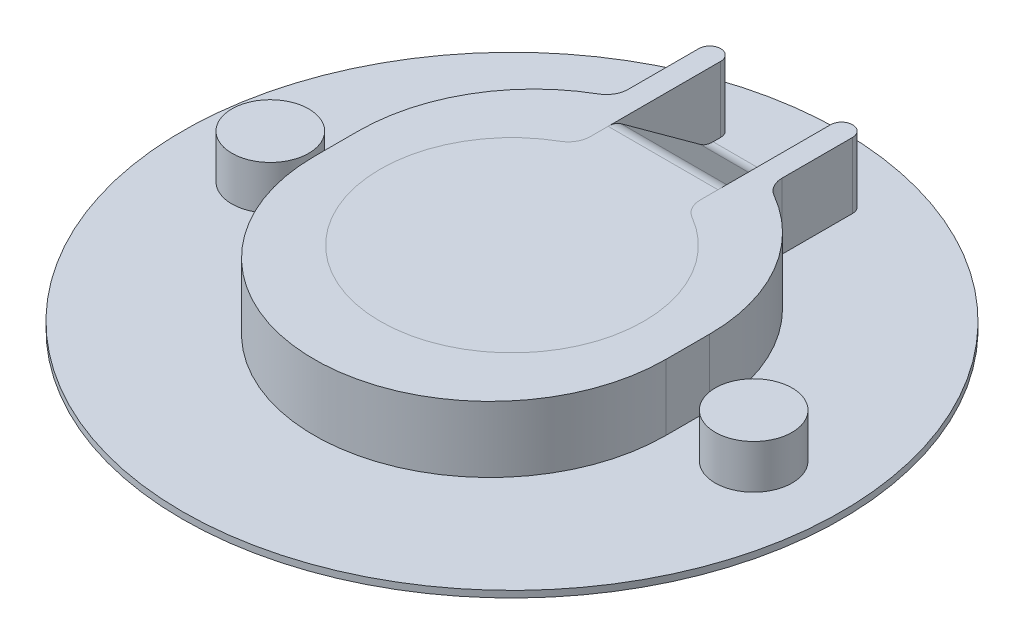
ISO-10303-21;
HEADER;
FILE_DESCRIPTION(('STEP AP214'),'2;1');
FILE_NAME('part.step','',(''),(''),'','','');
FILE_SCHEMA(('AUTOMOTIVE_DESIGN { 1 0 10303 214 1 1 1 1 }'));
ENDSEC;
DATA;
#1=APPLICATION_CONTEXT('core data for automotive mechanical design processes');
#2=APPLICATION_PROTOCOL_DEFINITION('international standard','automotive_design',2000,#1);
#3=PRODUCT_CONTEXT('',#1,'mechanical');
#4=PRODUCT('Part','Part','',(#3));
#5=PRODUCT_RELATED_PRODUCT_CATEGORY('part','',(#4));
#6=PRODUCT_DEFINITION_FORMATION('','',#4);
#7=PRODUCT_DEFINITION_CONTEXT('part definition',#1,'design');
#8=PRODUCT_DEFINITION('design','',#6,#7);
#9=PRODUCT_DEFINITION_SHAPE('','',#8);
#10=(LENGTH_UNIT() NAMED_UNIT(*) SI_UNIT(.MILLI.,.METRE.));
#11=(NAMED_UNIT(*) PLANE_ANGLE_UNIT() SI_UNIT($,.RADIAN.));
#12=(NAMED_UNIT(*) SI_UNIT($,.STERADIAN.) SOLID_ANGLE_UNIT());
#13=UNCERTAINTY_MEASURE_WITH_UNIT(LENGTH_MEASURE(1.E-05),#10,'distance_accuracy_value','');
#14=(GEOMETRIC_REPRESENTATION_CONTEXT(3) GLOBAL_UNCERTAINTY_ASSIGNED_CONTEXT((#13)) GLOBAL_UNIT_ASSIGNED_CONTEXT((#10,
#11,#12)) REPRESENTATION_CONTEXT('',''));
#15=CARTESIAN_POINT('',(0.,0.,0.));
#16=DIRECTION('',(0.,0.,1.));
#17=DIRECTION('',(1.,0.,0.));
#18=AXIS2_PLACEMENT_3D('',#15,#16,#17);
#19=CARTESIAN_POINT('',(0.,3.3,0.));
#20=DIRECTION('',(0.,1.,0.));
#21=DIRECTION('',(0.,0.,1.));
#22=AXIS2_PLACEMENT_3D('',#19,#20,#21);
#23=PLANE('',#22);
#24=CARTESIAN_POINT('',(3.5,3.3,-6.06217782649107));
#25=DIRECTION('',(0.,1.,0.));
#26=DIRECTION('',(0.,0.,1.));
#27=AXIS2_PLACEMENT_3D('',#24,#25,#26);
#28=CIRCLE('',#27,1.);
#29=CARTESIAN_POINT('',(3.,3.3,-5.19615242270663));
#30=VERTEX_POINT('',#29);
#31=CARTESIAN_POINT('',(2.5,3.3,-6.06217782649107));
#32=VERTEX_POINT('',#31);
#33=EDGE_CURVE('E173',#30,#32,#28,.F.);
#34=ORIENTED_EDGE('',*,*,#33,.T.);
#35=DIRECTION('',(0.,0.,-1.));
#36=VECTOR('',#35,1.);
#37=CARTESIAN_POINT('',(2.5,3.3,0.));
#38=LINE('',#37,#36);
#39=CARTESIAN_POINT('',(2.5,3.3,-6.87508030376707));
#40=VERTEX_POINT('',#39);
#41=EDGE_CURVE('E13',#32,#40,#38,.T.);
#42=ORIENTED_EDGE('',*,*,#41,.T.);
#43=DIRECTION('',(1.,0.,0.));
#44=VECTOR('',#43,1.);
#45=CARTESIAN_POINT('',(0.,3.3,-6.87508030376707));
#46=LINE('',#45,#44);
#47=CARTESIAN_POINT('',(-2.5,3.3,-6.87508030376707));
#48=VERTEX_POINT('',#47);
#49=EDGE_CURVE('E411',#40,#48,#46,.F.);
#50=ORIENTED_EDGE('',*,*,#49,.T.);
#51=DIRECTION('',(0.,0.,1.));
#52=VECTOR('',#51,1.);
#53=CARTESIAN_POINT('',(-2.5,3.3,0.));
#54=LINE('',#53,#52);
#55=CARTESIAN_POINT('',(-2.5,3.3,-6.06217782649107));
#56=VERTEX_POINT('',#55);
#57=EDGE_CURVE('E419',#48,#56,#54,.T.);
#58=ORIENTED_EDGE('',*,*,#57,.T.);
#59=CARTESIAN_POINT('',(-3.5,3.3,-6.06217782649107));
#60=DIRECTION('',(0.,1.,0.));
#61=DIRECTION('',(0.,0.,1.));
#62=AXIS2_PLACEMENT_3D('',#59,#60,#61);
#63=CIRCLE('',#62,1.);
#64=CARTESIAN_POINT('',(-3.,3.3,-5.19615242270664));
#65=VERTEX_POINT('',#64);
#66=EDGE_CURVE('E423',#56,#65,#63,.F.);
#67=ORIENTED_EDGE('',*,*,#66,.T.);
#68=CARTESIAN_POINT('',(0.,3.3,0.));
#69=DIRECTION('',(0.,1.,0.));
#70=DIRECTION('',(0.,0.,1.));
#71=AXIS2_PLACEMENT_3D('',#68,#69,#70);
#72=CIRCLE('',#71,6.);
#73=EDGE_CURVE('E427',#65,#30,#72,.T.);
#74=ORIENTED_EDGE('',*,*,#73,.T.);
#75=EDGE_LOOP('',(#34,#42,#50,#58,#67,#74));
#76=FACE_BOUND('',#75,.T.);
#77=ADVANCED_FACE('F164',(#76),#23,.T.);
#78=CARTESIAN_POINT('',(3.5,0.29,16.4624993421338));
#79=DIRECTION('',(-1.,0.,0.));
#80=DIRECTION('',(0.,0.,1.));
#81=AXIS2_PLACEMENT_3D('',#78,#79,#80);
#82=PLANE('',#81);
#83=DIRECTION('',(0.,0.,1.));
#84=VECTOR('',#83,1.);
#85=CARTESIAN_POINT('',(3.5,3.3,-11.4));
#86=LINE('',#85,#84);
#87=CARTESIAN_POINT('',(3.5,3.3,-12.));
#88=VERTEX_POINT('',#87);
#89=CARTESIAN_POINT('',(3.5,3.3,-8.79422863405995));
#90=VERTEX_POINT('',#89);
#91=EDGE_CURVE('E341',#88,#90,#86,.T.);
#92=ORIENTED_EDGE('',*,*,#91,.T.);
#93=DIRECTION('',(0.,1.,0.));
#94=VECTOR('',#93,1.);
#95=CARTESIAN_POINT('',(3.5,0.3,-8.79422863405995));
#96=LINE('',#95,#94);
#97=CARTESIAN_POINT('',(3.5,0.3,-8.79422863405995));
#98=VERTEX_POINT('',#97);
#99=EDGE_CURVE('E391',#90,#98,#96,.F.);
#100=ORIENTED_EDGE('',*,*,#99,.T.);
#101=DIRECTION('',(0.,0.,1.));
#102=VECTOR('',#101,1.);
#103=CARTESIAN_POINT('',(3.5,0.3,-11.4));
#104=LINE('',#103,#102);
#105=CARTESIAN_POINT('',(3.5,0.3,-12.));
#106=VERTEX_POINT('',#105);
#107=EDGE_CURVE('E366',#106,#98,#104,.T.);
#108=ORIENTED_EDGE('',*,*,#107,.F.);
#109=DIRECTION('',(0.,-1.,0.));
#110=VECTOR('',#109,1.);
#111=CARTESIAN_POINT('',(3.5,3.3,-12.));
#112=LINE('',#111,#110);
#113=EDGE_CURVE('E364',#88,#106,#112,.T.);
#114=ORIENTED_EDGE('',*,*,#113,.F.);
#115=EDGE_LOOP('',(#92,#100,#108,#114));
#116=FACE_BOUND('',#115,.T.);
#117=ADVANCED_FACE('F499',(#116),#82,.F.);
#118=CARTESIAN_POINT('',(2.5,0.29,16.4624993421338));
#119=DIRECTION('',(1.,0.,0.));
#120=DIRECTION('',(0.,0.,-1.));
#121=AXIS2_PLACEMENT_3D('',#118,#119,#120);
#122=PLANE('',#121);
#123=DIRECTION('',(0.,0.,-1.));
#124=VECTOR('',#123,1.);
#125=CARTESIAN_POINT('',(2.5,0.3,0.));
#126=LINE('',#125,#124);
#127=CARTESIAN_POINT('',(2.5,0.3,-11.6540654576464));
#128=VERTEX_POINT('',#127);
#129=CARTESIAN_POINT('',(2.5,0.3,-12.));
#130=VERTEX_POINT('',#129);
#131=EDGE_CURVE('E370',#128,#130,#126,.T.);
#132=ORIENTED_EDGE('',*,*,#131,.F.);
#133=CARTESIAN_POINT('',(2.5,1.3,-11.6540654576464));
#134=DIRECTION('',(1.,0.,0.));
#135=DIRECTION('',(0.,0.,-1.));
#136=AXIS2_PLACEMENT_3D('',#133,#134,#135);
#137=CIRCLE('',#136,1.);
#138=CARTESIAN_POINT('',(2.5,0.490983005625051,-11.0662802053539));
#139=VERTEX_POINT('',#138);
#140=EDGE_CURVE('E403',#128,#139,#137,.F.);
#141=ORIENTED_EDGE('',*,*,#140,.T.);
#142=DIRECTION('',(0.,-0.587785252292478,-0.809016994374944));
#143=VECTOR('',#142,1.);
#144=CARTESIAN_POINT('',(2.5,13.5122576721174,6.85596682709528));
#145=LINE('',#144,#143);
#146=CARTESIAN_POINT('',(2.5,3.10901699437494,-7.46286555605955));
#147=VERTEX_POINT('',#146);
#148=EDGE_CURVE('E452',#139,#147,#145,.F.);
#149=ORIENTED_EDGE('',*,*,#148,.T.);
#150=CARTESIAN_POINT('',(2.5,2.3,-6.87508030376707));
#151=DIRECTION('',(1.,0.,0.));
#152=DIRECTION('',(0.,0.,-1.));
#153=AXIS2_PLACEMENT_3D('',#150,#151,#152);
#154=CIRCLE('',#153,1.);
#155=EDGE_CURVE('E416',#147,#40,#154,.T.);
#156=ORIENTED_EDGE('',*,*,#155,.T.);
#157=DIRECTION('',(0.,0.,-1.));
#158=VECTOR('',#157,1.);
#159=CARTESIAN_POINT('',(2.5,3.3,0.));
#160=LINE('',#159,#158);
#161=CARTESIAN_POINT('',(2.5,3.3,-12.));
#162=VERTEX_POINT('',#161);
#163=EDGE_CURVE('E371',#40,#162,#160,.T.);
#164=ORIENTED_EDGE('',*,*,#163,.T.);
#165=DIRECTION('',(0.,-1.,0.));
#166=VECTOR('',#165,1.);
#167=CARTESIAN_POINT('',(2.5,3.3,-12.));
#168=LINE('',#167,#166);
#169=EDGE_CURVE('E360',#162,#130,#168,.T.);
#170=ORIENTED_EDGE('',*,*,#169,.T.);
#171=EDGE_LOOP('',(#132,#141,#149,#156,#164,#170));
#172=FACE_BOUND('',#171,.T.);
#173=ADVANCED_FACE('F504',(#172),#122,.F.);
#174=CARTESIAN_POINT('',(3.,3.3,-12.));
#175=DIRECTION('',(0.,-1.,0.));
#176=DIRECTION('',(0.,0.,-1.));
#177=AXIS2_PLACEMENT_3D('',#174,#175,#176);
#178=CYLINDRICAL_SURFACE('',#177,0.499999999999998);
#179=CARTESIAN_POINT('',(3.,0.3,-12.));
#180=DIRECTION('',(0.,-1.,0.));
#181=DIRECTION('',(0.,0.,-1.));
#182=AXIS2_PLACEMENT_3D('',#179,#180,#181);
#183=CIRCLE('',#182,0.499999999999998);
#184=EDGE_CURVE('E367',#130,#106,#183,.T.);
#185=ORIENTED_EDGE('',*,*,#184,.F.);
#186=ORIENTED_EDGE('',*,*,#169,.F.);
#187=CARTESIAN_POINT('',(3.,3.3,-12.));
#188=DIRECTION('',(0.,-1.,0.));
#189=DIRECTION('',(0.,0.,-1.));
#190=AXIS2_PLACEMENT_3D('',#187,#188,#189);
#191=CIRCLE('',#190,0.499999999999998);
#192=EDGE_CURVE('E363',#162,#88,#191,.T.);
#193=ORIENTED_EDGE('',*,*,#192,.T.);
#194=ORIENTED_EDGE('',*,*,#113,.T.);
#195=EDGE_LOOP('',(#185,#186,#193,#194));
#196=FACE_BOUND('',#195,.T.);
#197=ADVANCED_FACE('F518',(#196),#178,.T.);
#198=CARTESIAN_POINT('',(0.,3.3,1.));
#199=DIRECTION('',(0.,-1.,0.));
#200=DIRECTION('',(0.,0.,-1.));
#201=AXIS2_PLACEMENT_3D('',#198,#199,#200);
#202=CYLINDRICAL_SURFACE('',#201,8.);
#203=CARTESIAN_POINT('',(0.,3.3,1.));
#204=DIRECTION('',(0.,1.,0.));
#205=DIRECTION('',(0.,0.,1.));
#206=AXIS2_PLACEMENT_3D('',#203,#204,#205);
#207=CIRCLE('',#206,8.);
#208=CARTESIAN_POINT('',(-8.,3.3,0.999999999999999));
#209=VERTEX_POINT('',#208);
#210=CARTESIAN_POINT('',(8.,3.3,1.));
#211=VERTEX_POINT('',#210);
#212=EDGE_CURVE('E373',#209,#211,#207,.T.);
#213=ORIENTED_EDGE('',*,*,#212,.F.);
#214=DIRECTION('',(0.,-1.,0.));
#215=VECTOR('',#214,1.);
#216=CARTESIAN_POINT('',(-8.,3.3,0.999999999999999));
#217=LINE('',#216,#215);
#218=CARTESIAN_POINT('',(-8.,0.3,0.999999999999999));
#219=VERTEX_POINT('',#218);
#220=EDGE_CURVE('E304',#209,#219,#217,.T.);
#221=ORIENTED_EDGE('',*,*,#220,.T.);
#222=CARTESIAN_POINT('',(0.,0.3,1.));
#223=DIRECTION('',(0.,1.,0.));
#224=DIRECTION('',(0.,0.,1.));
#225=AXIS2_PLACEMENT_3D('',#222,#223,#224);
#226=CIRCLE('',#225,8.);
#227=CARTESIAN_POINT('',(8.,0.3,1.));
#228=VERTEX_POINT('',#227);
#229=EDGE_CURVE('E380',#219,#228,#226,.T.);
#230=ORIENTED_EDGE('',*,*,#229,.T.);
#231=DIRECTION('',(0.,-1.,0.));
#232=VECTOR('',#231,1.);
#233=CARTESIAN_POINT('',(8.,3.3,1.));
#234=LINE('',#233,#232);
#235=EDGE_CURVE('E296',#211,#228,#234,.T.);
#236=ORIENTED_EDGE('',*,*,#235,.F.);
#237=EDGE_LOOP('',(#213,#221,#230,#236));
#238=FACE_BOUND('',#237,.T.);
#239=ADVANCED_FACE('F511',(#238),#202,.T.);
#240=ORIENTED_EDGE('',*,*,#41,.F.);
#241=ORIENTED_EDGE('',*,*,#33,.F.);
#242=ORIENTED_EDGE('',*,*,#73,.F.);
#243=ORIENTED_EDGE('',*,*,#66,.F.);
#244=ORIENTED_EDGE('',*,*,#57,.F.);
#245=DIRECTION('',(0.,0.,-1.));
#246=VECTOR('',#245,1.);
#247=CARTESIAN_POINT('',(-2.5,3.3,0.));
#248=LINE('',#247,#246);
#249=CARTESIAN_POINT('',(-2.5,3.3,-12.));
#250=VERTEX_POINT('',#249);
#251=EDGE_CURVE('E346',#48,#250,#248,.T.);
#252=ORIENTED_EDGE('',*,*,#251,.T.);
#253=CARTESIAN_POINT('',(-3.,3.3,-12.));
#254=DIRECTION('',(0.,1.,0.));
#255=DIRECTION('',(0.,0.,1.));
#256=AXIS2_PLACEMENT_3D('',#253,#254,#255);
#257=CIRCLE('',#256,0.499999999999998);
#258=CARTESIAN_POINT('',(-3.5,3.3,-12.));
#259=VERTEX_POINT('',#258);
#260=EDGE_CURVE('E348',#250,#259,#257,.T.);
#261=ORIENTED_EDGE('',*,*,#260,.T.);
#262=DIRECTION('',(0.,0.,1.));
#263=VECTOR('',#262,1.);
#264=CARTESIAN_POINT('',(-3.5,3.3,-11.4));
#265=LINE('',#264,#263);
#266=CARTESIAN_POINT('',(-3.5,3.3,-8.79422863405995));
#267=VERTEX_POINT('',#266);
#268=EDGE_CURVE('E338',#259,#267,#265,.T.);
#269=ORIENTED_EDGE('',*,*,#268,.T.);
#270=CARTESIAN_POINT('',(-4.5,3.3,-8.79422863405995));
#271=DIRECTION('',(0.,1.,0.));
#272=DIRECTION('',(0.,0.,1.));
#273=AXIS2_PLACEMENT_3D('',#270,#271,#272);
#274=CIRCLE('',#273,1.);
#275=CARTESIAN_POINT('',(-4.,3.3,-7.92820323027551));
#276=VERTEX_POINT('',#275);
#277=EDGE_CURVE('E396',#267,#276,#274,.F.);
#278=ORIENTED_EDGE('',*,*,#277,.T.);
#279=CARTESIAN_POINT('',(0.,3.3,-1.));
#280=DIRECTION('',(0.,1.,0.));
#281=DIRECTION('',(0.,0.,1.));
#282=AXIS2_PLACEMENT_3D('',#279,#280,#281);
#283=CIRCLE('',#282,8.);
#284=CARTESIAN_POINT('',(-8.,3.3,-1.));
#285=VERTEX_POINT('',#284);
#286=EDGE_CURVE('E321',#276,#285,#283,.T.);
#287=ORIENTED_EDGE('',*,*,#286,.T.);
#288=DIRECTION('',(0.,0.,1.));
#289=VECTOR('',#288,1.);
#290=CARTESIAN_POINT('',(-8.,3.3,-1.));
#291=LINE('',#290,#289);
#292=EDGE_CURVE('E327',#285,#209,#291,.T.);
#293=ORIENTED_EDGE('',*,*,#292,.T.);
#294=ORIENTED_EDGE('',*,*,#212,.T.);
#295=DIRECTION('',(0.,0.,1.));
#296=VECTOR('',#295,1.);
#297=CARTESIAN_POINT('',(8.,3.3,-1.));
#298=LINE('',#297,#296);
#299=CARTESIAN_POINT('',(8.,3.3,-1.));
#300=VERTEX_POINT('',#299);
#301=EDGE_CURVE('E311',#300,#211,#298,.T.);
#302=ORIENTED_EDGE('',*,*,#301,.F.);
#303=CARTESIAN_POINT('',(0.,3.3,-1.));
#304=DIRECTION('',(0.,1.,0.));
#305=DIRECTION('',(0.,0.,1.));
#306=AXIS2_PLACEMENT_3D('',#303,#304,#305);
#307=CIRCLE('',#306,8.);
#308=CARTESIAN_POINT('',(4.,3.3,-7.92820323027551));
#309=VERTEX_POINT('',#308);
#310=EDGE_CURVE('E292',#300,#309,#307,.T.);
#311=ORIENTED_EDGE('',*,*,#310,.T.);
#312=CARTESIAN_POINT('',(4.5,3.3,-8.79422863405995));
#313=DIRECTION('',(0.,1.,0.));
#314=DIRECTION('',(0.,0.,1.));
#315=AXIS2_PLACEMENT_3D('',#312,#313,#314);
#316=CIRCLE('',#315,1.);
#317=EDGE_CURVE('E398',#309,#90,#316,.F.);
#318=ORIENTED_EDGE('',*,*,#317,.T.);
#319=ORIENTED_EDGE('',*,*,#91,.F.);
#320=ORIENTED_EDGE('',*,*,#192,.F.);
#321=ORIENTED_EDGE('',*,*,#163,.F.);
#322=EDGE_LOOP('',(#240,#241,#242,#243,#244,#252,#261,#269,#278,#287,#293,#294,#302,#311,#318,
#319,#320,#321));
#323=FACE_BOUND('',#322,.T.);
#324=ADVANCED_FACE('F433',(#323),#23,.T.);
#325=CARTESIAN_POINT('',(-3.5,3.3,-11.4));
#326=DIRECTION('',(1.,0.,0.));
#327=DIRECTION('',(0.,0.,-1.));
#328=AXIS2_PLACEMENT_3D('',#325,#326,#327);
#329=PLANE('',#328);
#330=DIRECTION('',(0.,0.,1.));
#331=VECTOR('',#330,1.);
#332=CARTESIAN_POINT('',(-3.5,0.3,-11.4));
#333=LINE('',#332,#331);
#334=CARTESIAN_POINT('',(-3.5,0.3,-12.));
#335=VERTEX_POINT('',#334);
#336=CARTESIAN_POINT('',(-3.5,0.3,-8.79422863405995));
#337=VERTEX_POINT('',#336);
#338=EDGE_CURVE('E342',#335,#337,#333,.T.);
#339=ORIENTED_EDGE('',*,*,#338,.T.);
#340=DIRECTION('',(0.,1.,0.));
#341=VECTOR('',#340,1.);
#342=CARTESIAN_POINT('',(-3.5,3.3,-8.79422863405995));
#343=LINE('',#342,#341);
#344=EDGE_CURVE('E389',#337,#267,#343,.T.);
#345=ORIENTED_EDGE('',*,*,#344,.T.);
#346=ORIENTED_EDGE('',*,*,#268,.F.);
#347=DIRECTION('',(0.,-1.,0.));
#348=VECTOR('',#347,1.);
#349=CARTESIAN_POINT('',(-3.5,3.3,-12.));
#350=LINE('',#349,#348);
#351=EDGE_CURVE('E352',#259,#335,#350,.T.);
#352=ORIENTED_EDGE('',*,*,#351,.T.);
#353=EDGE_LOOP('',(#339,#345,#346,#352));
#354=FACE_BOUND('',#353,.T.);
#355=ADVANCED_FACE('F510',(#354),#329,.F.);
#356=CARTESIAN_POINT('',(-3.,3.3,-12.));
#357=DIRECTION('',(0.,-1.,0.));
#358=DIRECTION('',(0.,0.,-1.));
#359=AXIS2_PLACEMENT_3D('',#356,#357,#358);
#360=CYLINDRICAL_SURFACE('',#359,0.499999999999998);
#361=CARTESIAN_POINT('',(-3.,0.3,-12.));
#362=DIRECTION('',(0.,1.,0.));
#363=DIRECTION('',(0.,0.,1.));
#364=AXIS2_PLACEMENT_3D('',#361,#362,#363);
#365=CIRCLE('',#364,0.499999999999998);
#366=CARTESIAN_POINT('',(-2.5,0.3,-12.));
#367=VERTEX_POINT('',#366);
#368=EDGE_CURVE('E349',#367,#335,#365,.T.);
#369=ORIENTED_EDGE('',*,*,#368,.T.);
#370=ORIENTED_EDGE('',*,*,#351,.F.);
#371=ORIENTED_EDGE('',*,*,#260,.F.);
#372=DIRECTION('',(0.,-1.,0.));
#373=VECTOR('',#372,1.);
#374=CARTESIAN_POINT('',(-2.5,3.3,-12.));
#375=LINE('',#374,#373);
#376=EDGE_CURVE('E345',#250,#367,#375,.T.);
#377=ORIENTED_EDGE('',*,*,#376,.T.);
#378=EDGE_LOOP('',(#369,#370,#371,#377));
#379=FACE_BOUND('',#378,.T.);
#380=ADVANCED_FACE('F483',(#379),#360,.T.);
#381=CARTESIAN_POINT('',(-2.5,3.3,0.));
#382=DIRECTION('',(-1.,0.,0.));
#383=DIRECTION('',(0.,0.,1.));
#384=AXIS2_PLACEMENT_3D('',#381,#382,#383);
#385=PLANE('',#384);
#386=DIRECTION('',(0.,0.587785252292478,0.809016994374944));
#387=VECTOR('',#386,1.);
#388=CARTESIAN_POINT('',(-2.5,0.24852138237743,-11.4));
#389=LINE('',#388,#387);
#390=CARTESIAN_POINT('',(-2.5,3.10901699437494,-7.46286555605955));
#391=VERTEX_POINT('',#390);
#392=CARTESIAN_POINT('',(-2.5,0.490983005625056,-11.0662802053539));
#393=VERTEX_POINT('',#392);
#394=EDGE_CURVE('E444',#391,#393,#389,.F.);
#395=ORIENTED_EDGE('',*,*,#394,.T.);
#396=CARTESIAN_POINT('',(-2.5,1.3,-11.6540654576464));
#397=DIRECTION('',(-1.,0.,0.));
#398=DIRECTION('',(0.,0.,1.));
#399=AXIS2_PLACEMENT_3D('',#396,#397,#398);
#400=CIRCLE('',#399,1.);
#401=CARTESIAN_POINT('',(-2.5,0.3,-11.6540654576464));
#402=VERTEX_POINT('',#401);
#403=EDGE_CURVE('E409',#393,#402,#400,.F.);
#404=ORIENTED_EDGE('',*,*,#403,.T.);
#405=DIRECTION('',(0.,0.,-1.));
#406=VECTOR('',#405,1.);
#407=CARTESIAN_POINT('',(-2.5,0.3,0.));
#408=LINE('',#407,#406);
#409=EDGE_CURVE('E335',#402,#367,#408,.T.);
#410=ORIENTED_EDGE('',*,*,#409,.T.);
#411=ORIENTED_EDGE('',*,*,#376,.F.);
#412=ORIENTED_EDGE('',*,*,#251,.F.);
#413=CARTESIAN_POINT('',(-2.5,2.3,-6.87508030376707));
#414=DIRECTION('',(-1.,0.,0.));
#415=DIRECTION('',(0.,0.,1.));
#416=AXIS2_PLACEMENT_3D('',#413,#414,#415);
#417=CIRCLE('',#416,1.);
#418=EDGE_CURVE('E414',#48,#391,#417,.T.);
#419=ORIENTED_EDGE('',*,*,#418,.T.);
#420=EDGE_LOOP('',(#395,#404,#410,#411,#412,#419));
#421=FACE_BOUND('',#420,.T.);
#422=ADVANCED_FACE('F443',(#421),#385,.F.);
#423=CARTESIAN_POINT('',(0.,0.3,0.));
#424=DIRECTION('',(0.,1.,0.));
#425=DIRECTION('',(0.,0.,1.));
#426=AXIS2_PLACEMENT_3D('',#423,#424,#425);
#427=PLANE('',#426);
#428=CARTESIAN_POINT('',(11.,0.3,0.));
#429=DIRECTION('',(0.,1.,0.));
#430=DIRECTION('',(0.,0.,1.));
#431=AXIS2_PLACEMENT_3D('',#428,#429,#430);
#432=CIRCLE('',#431,1.75);
#433=CARTESIAN_POINT('',(11.,0.3,1.75));
#434=VERTEX_POINT('',#433);
#435=EDGE_CURVE('E464',#434,#434,#432,.T.);
#436=ORIENTED_EDGE('',*,*,#435,.F.);
#437=EDGE_LOOP('',(#436));
#438=FACE_BOUND('',#437,.T.);
#439=CARTESIAN_POINT('',(-11.,0.3,0.));
#440=DIRECTION('',(0.,1.,0.));
#441=DIRECTION('',(0.,0.,1.));
#442=AXIS2_PLACEMENT_3D('',#439,#440,#441);
#443=CIRCLE('',#442,1.75);
#444=CARTESIAN_POINT('',(-11.,0.3,1.75));
#445=VERTEX_POINT('',#444);
#446=EDGE_CURVE('E458',#445,#445,#443,.T.);
#447=ORIENTED_EDGE('',*,*,#446,.F.);
#448=EDGE_LOOP('',(#447));
#449=FACE_BOUND('',#448,.T.);
#450=ORIENTED_EDGE('',*,*,#409,.F.);
#451=DIRECTION('',(-1.,0.,0.));
#452=VECTOR('',#451,1.);
#453=CARTESIAN_POINT('',(2.5,0.3,-11.6540654576464));
#454=LINE('',#453,#452);
#455=EDGE_CURVE('E400',#402,#128,#454,.F.);
#456=ORIENTED_EDGE('',*,*,#455,.T.);
#457=ORIENTED_EDGE('',*,*,#131,.T.);
#458=ORIENTED_EDGE('',*,*,#184,.T.);
#459=ORIENTED_EDGE('',*,*,#107,.T.);
#460=CARTESIAN_POINT('',(4.5,0.3,-8.79422863405995));
#461=DIRECTION('',(0.,1.,0.));
#462=DIRECTION('',(0.,0.,1.));
#463=AXIS2_PLACEMENT_3D('',#460,#461,#462);
#464=CIRCLE('',#463,1.);
#465=CARTESIAN_POINT('',(4.,0.3,-7.92820323027551));
#466=VERTEX_POINT('',#465);
#467=EDGE_CURVE('E310',#98,#466,#464,.T.);
#468=ORIENTED_EDGE('',*,*,#467,.T.);
#469=CARTESIAN_POINT('',(0.,0.3,-1.));
#470=DIRECTION('',(0.,1.,0.));
#471=DIRECTION('',(0.,0.,1.));
#472=AXIS2_PLACEMENT_3D('',#469,#470,#471);
#473=CIRCLE('',#472,8.);
#474=CARTESIAN_POINT('',(8.,0.3,-1.));
#475=VERTEX_POINT('',#474);
#476=EDGE_CURVE('E289',#475,#466,#473,.T.);
#477=ORIENTED_EDGE('',*,*,#476,.F.);
#478=DIRECTION('',(0.,0.,1.));
#479=VECTOR('',#478,1.);
#480=CARTESIAN_POINT('',(8.,0.3,-1.));
#481=LINE('',#480,#479);
#482=EDGE_CURVE('E300',#475,#228,#481,.T.);
#483=ORIENTED_EDGE('',*,*,#482,.T.);
#484=ORIENTED_EDGE('',*,*,#229,.F.);
#485=DIRECTION('',(0.,0.,1.));
#486=VECTOR('',#485,1.);
#487=CARTESIAN_POINT('',(-8.,0.3,-1.));
#488=LINE('',#487,#486);
#489=CARTESIAN_POINT('',(-8.,0.3,-1.));
#490=VERTEX_POINT('',#489);
#491=EDGE_CURVE('E322',#490,#219,#488,.T.);
#492=ORIENTED_EDGE('',*,*,#491,.F.);
#493=CARTESIAN_POINT('',(0.,0.3,-1.));
#494=DIRECTION('',(0.,1.,0.));
#495=DIRECTION('',(0.,0.,1.));
#496=AXIS2_PLACEMENT_3D('',#493,#494,#495);
#497=CIRCLE('',#496,8.);
#498=CARTESIAN_POINT('',(-4.,0.3,-7.92820323027551));
#499=VERTEX_POINT('',#498);
#500=EDGE_CURVE('E326',#499,#490,#497,.T.);
#501=ORIENTED_EDGE('',*,*,#500,.F.);
#502=CARTESIAN_POINT('',(-4.5,0.3,-8.79422863405995));
#503=DIRECTION('',(0.,1.,0.));
#504=DIRECTION('',(0.,0.,1.));
#505=AXIS2_PLACEMENT_3D('',#502,#503,#504);
#506=CIRCLE('',#505,1.);
#507=EDGE_CURVE('E387',#499,#337,#506,.T.);
#508=ORIENTED_EDGE('',*,*,#507,.T.);
#509=ORIENTED_EDGE('',*,*,#338,.F.);
#510=ORIENTED_EDGE('',*,*,#368,.F.);
#511=EDGE_LOOP('',(#450,#456,#457,#458,#459,#468,#477,#483,#484,#492,#501,#508,#509,#510));
#512=FACE_BOUND('',#511,.T.);
#513=CARTESIAN_POINT('',(0.,0.3,0.));
#514=DIRECTION('',(0.,1.,0.));
#515=DIRECTION('',(0.,0.,1.));
#516=AXIS2_PLACEMENT_3D('',#513,#514,#515);
#517=CIRCLE('',#516,15.);
#518=CARTESIAN_POINT('',(0.,0.3,15.));
#519=VERTEX_POINT('',#518);
#520=EDGE_CURVE('E332',#519,#519,#517,.T.);
#521=ORIENTED_EDGE('',*,*,#520,.T.);
#522=EDGE_LOOP('',(#521));
#523=FACE_BOUND('',#522,.T.);
#524=ADVANCED_FACE('F307',(#438,#449,#512,#523),#427,.T.);
#525=CARTESIAN_POINT('',(0.,0.3,0.));
#526=DIRECTION('',(0.,-1.,0.));
#527=DIRECTION('',(0.,0.,-1.));
#528=AXIS2_PLACEMENT_3D('',#525,#526,#527);
#529=CYLINDRICAL_SURFACE('',#528,15.);
#530=ORIENTED_EDGE('',*,*,#520,.F.);
#531=EDGE_LOOP('',(#530));
#532=FACE_BOUND('',#531,.T.);
#533=CARTESIAN_POINT('',(0.,0.,0.));
#534=DIRECTION('',(0.,1.,0.));
#535=DIRECTION('',(0.,0.,1.));
#536=AXIS2_PLACEMENT_3D('',#533,#534,#535);
#537=CIRCLE('',#536,15.);
#538=CARTESIAN_POINT('',(0.,0.,15.));
#539=VERTEX_POINT('',#538);
#540=EDGE_CURVE('E325',#539,#539,#537,.T.);
#541=ORIENTED_EDGE('',*,*,#540,.T.);
#542=EDGE_LOOP('',(#541));
#543=FACE_BOUND('',#542,.T.);
#544=ADVANCED_FACE('F481',(#532,#543),#529,.T.);
#545=CARTESIAN_POINT('',(0.,0.,0.));
#546=DIRECTION('',(0.,1.,0.));
#547=DIRECTION('',(0.,0.,1.));
#548=AXIS2_PLACEMENT_3D('',#545,#546,#547);
#549=PLANE('',#548);
#550=ORIENTED_EDGE('',*,*,#540,.F.);
#551=EDGE_LOOP('',(#550));
#552=FACE_BOUND('',#551,.T.);
#553=ADVANCED_FACE('F537',(#552),#549,.F.);
#554=CARTESIAN_POINT('',(0.,3.3,-1.));
#555=DIRECTION('',(0.,-1.,0.));
#556=DIRECTION('',(0.,0.,-1.));
#557=AXIS2_PLACEMENT_3D('',#554,#555,#556);
#558=CYLINDRICAL_SURFACE('',#557,8.);
#559=ORIENTED_EDGE('',*,*,#286,.F.);
#560=DIRECTION('',(0.,-1.,0.));
#561=VECTOR('',#560,1.);
#562=CARTESIAN_POINT('',(-4.,3.3,-7.92820323027551));
#563=LINE('',#562,#561);
#564=EDGE_CURVE('E382',#276,#499,#563,.T.);
#565=ORIENTED_EDGE('',*,*,#564,.T.);
#566=ORIENTED_EDGE('',*,*,#500,.T.);
#567=DIRECTION('',(0.,-1.,0.));
#568=VECTOR('',#567,1.);
#569=CARTESIAN_POINT('',(-8.,3.3,-1.));
#570=LINE('',#569,#568);
#571=EDGE_CURVE('E318',#285,#490,#570,.T.);
#572=ORIENTED_EDGE('',*,*,#571,.F.);
#573=EDGE_LOOP('',(#559,#565,#566,#572));
#574=FACE_BOUND('',#573,.T.);
#575=ADVANCED_FACE('F540',(#574),#558,.T.);
#576=CARTESIAN_POINT('',(-8.,3.3,-1.));
#577=DIRECTION('',(1.,0.,0.));
#578=DIRECTION('',(0.,0.,-1.));
#579=AXIS2_PLACEMENT_3D('',#576,#577,#578);
#580=PLANE('',#579);
#581=ORIENTED_EDGE('',*,*,#491,.T.);
#582=ORIENTED_EDGE('',*,*,#220,.F.);
#583=ORIENTED_EDGE('',*,*,#292,.F.);
#584=ORIENTED_EDGE('',*,*,#571,.T.);
#585=EDGE_LOOP('',(#581,#582,#583,#584));
#586=FACE_BOUND('',#585,.T.);
#587=ADVANCED_FACE('F542',(#586),#580,.F.);
#588=CARTESIAN_POINT('',(8.,3.3,-1.));
#589=DIRECTION('',(1.,0.,0.));
#590=DIRECTION('',(0.,0.,-1.));
#591=AXIS2_PLACEMENT_3D('',#588,#589,#590);
#592=PLANE('',#591);
#593=ORIENTED_EDGE('',*,*,#482,.F.);
#594=DIRECTION('',(0.,-1.,0.));
#595=VECTOR('',#594,1.);
#596=CARTESIAN_POINT('',(8.,3.3,-1.));
#597=LINE('',#596,#595);
#598=EDGE_CURVE('E285',#300,#475,#597,.T.);
#599=ORIENTED_EDGE('',*,*,#598,.F.);
#600=ORIENTED_EDGE('',*,*,#301,.T.);
#601=ORIENTED_EDGE('',*,*,#235,.T.);
#602=EDGE_LOOP('',(#593,#599,#600,#601));
#603=FACE_BOUND('',#602,.T.);
#604=ADVANCED_FACE('F301',(#603),#592,.T.);
#605=CARTESIAN_POINT('',(0.,3.3,-1.));
#606=DIRECTION('',(0.,-1.,0.));
#607=DIRECTION('',(0.,0.,-1.));
#608=AXIS2_PLACEMENT_3D('',#605,#606,#607);
#609=CYLINDRICAL_SURFACE('',#608,8.);
#610=ORIENTED_EDGE('',*,*,#476,.T.);
#611=DIRECTION('',(0.,-1.,0.));
#612=VECTOR('',#611,1.);
#613=CARTESIAN_POINT('',(4.,3.3,-7.92820323027551));
#614=LINE('',#613,#612);
#615=EDGE_CURVE('E394',#466,#309,#614,.F.);
#616=ORIENTED_EDGE('',*,*,#615,.T.);
#617=ORIENTED_EDGE('',*,*,#310,.F.);
#618=ORIENTED_EDGE('',*,*,#598,.T.);
#619=EDGE_LOOP('',(#610,#616,#617,#618));
#620=FACE_BOUND('',#619,.T.);
#621=ADVANCED_FACE('F287',(#620),#609,.T.);
#622=CARTESIAN_POINT('',(-3.5,0.24852138237743,-11.4));
#623=DIRECTION('',(0.,-0.809016994374944,0.587785252292478));
#624=DIRECTION('',(1.,0.,0.));
#625=AXIS2_PLACEMENT_3D('',#622,#623,#624);
#626=PLANE('',#625);
#627=ORIENTED_EDGE('',*,*,#148,.F.);
#628=DIRECTION('',(1.,0.,0.));
#629=VECTOR('',#628,1.);
#630=CARTESIAN_POINT('',(-2.5,0.490983005625056,-11.0662802053539));
#631=LINE('',#630,#629);
#632=EDGE_CURVE('E407',#139,#393,#631,.F.);
#633=ORIENTED_EDGE('',*,*,#632,.T.);
#634=ORIENTED_EDGE('',*,*,#394,.F.);
#635=DIRECTION('',(-1.,0.,0.));
#636=VECTOR('',#635,1.);
#637=CARTESIAN_POINT('',(-3.5,3.10901699437494,-7.46286555605955));
#638=LINE('',#637,#636);
#639=EDGE_CURVE('E405',#391,#147,#638,.F.);
#640=ORIENTED_EDGE('',*,*,#639,.T.);
#641=EDGE_LOOP('',(#627,#633,#634,#640));
#642=FACE_BOUND('',#641,.T.);
#643=ADVANCED_FACE('F449',(#642),#626,.F.);
#644=CARTESIAN_POINT('',(-11.,2.3,0.));
#645=DIRECTION('',(0.,-1.,0.));
#646=DIRECTION('',(0.,0.,-1.));
#647=AXIS2_PLACEMENT_3D('',#644,#645,#646);
#648=CYLINDRICAL_SURFACE('',#647,1.75);
#649=CARTESIAN_POINT('',(-11.,2.3,0.));
#650=DIRECTION('',(0.,1.,0.));
#651=DIRECTION('',(0.,0.,1.));
#652=AXIS2_PLACEMENT_3D('',#649,#650,#651);
#653=CIRCLE('',#652,1.75);
#654=CARTESIAN_POINT('',(-11.,2.3,1.75));
#655=VERTEX_POINT('',#654);
#656=EDGE_CURVE('E455',#655,#655,#653,.T.);
#657=ORIENTED_EDGE('',*,*,#656,.F.);
#658=EDGE_LOOP('',(#657));
#659=FACE_BOUND('',#658,.T.);
#660=ORIENTED_EDGE('',*,*,#446,.T.);
#661=EDGE_LOOP('',(#660));
#662=FACE_BOUND('',#661,.T.);
#663=ADVANCED_FACE('F486',(#659,#662),#648,.T.);
#664=CARTESIAN_POINT('',(-11.,2.3,0.));
#665=DIRECTION('',(0.,1.,0.));
#666=DIRECTION('',(0.,0.,1.));
#667=AXIS2_PLACEMENT_3D('',#664,#665,#666);
#668=PLANE('',#667);
#669=ORIENTED_EDGE('',*,*,#656,.T.);
#670=EDGE_LOOP('',(#669));
#671=FACE_BOUND('',#670,.T.);
#672=ADVANCED_FACE('F475',(#671),#668,.T.);
#673=CARTESIAN_POINT('',(11.,2.3,0.));
#674=DIRECTION('',(0.,-1.,0.));
#675=DIRECTION('',(0.,0.,-1.));
#676=AXIS2_PLACEMENT_3D('',#673,#674,#675);
#677=CYLINDRICAL_SURFACE('',#676,1.75);
#678=CARTESIAN_POINT('',(11.,2.3,0.));
#679=DIRECTION('',(0.,1.,0.));
#680=DIRECTION('',(0.,0.,1.));
#681=AXIS2_PLACEMENT_3D('',#678,#679,#680);
#682=CIRCLE('',#681,1.75);
#683=CARTESIAN_POINT('',(11.,2.3,1.75));
#684=VERTEX_POINT('',#683);
#685=EDGE_CURVE('E461',#684,#684,#682,.T.);
#686=ORIENTED_EDGE('',*,*,#685,.F.);
#687=EDGE_LOOP('',(#686));
#688=FACE_BOUND('',#687,.T.);
#689=ORIENTED_EDGE('',*,*,#435,.T.);
#690=EDGE_LOOP('',(#689));
#691=FACE_BOUND('',#690,.T.);
#692=ADVANCED_FACE('F472',(#688,#691),#677,.T.);
#693=CARTESIAN_POINT('',(11.,2.3,0.));
#694=DIRECTION('',(0.,1.,0.));
#695=DIRECTION('',(0.,0.,1.));
#696=AXIS2_PLACEMENT_3D('',#693,#694,#695);
#697=PLANE('',#696);
#698=ORIENTED_EDGE('',*,*,#685,.T.);
#699=EDGE_LOOP('',(#698));
#700=FACE_BOUND('',#699,.T.);
#701=ADVANCED_FACE('F470',(#700),#697,.T.);
#702=CARTESIAN_POINT('',(-4.5,3.3,-8.79422863405995));
#703=DIRECTION('',(0.,-1.,0.));
#704=DIRECTION('',(0.,0.,-1.));
#705=AXIS2_PLACEMENT_3D('',#702,#703,#704);
#706=CYLINDRICAL_SURFACE('',#705,1.);
#707=ORIENTED_EDGE('',*,*,#277,.F.);
#708=ORIENTED_EDGE('',*,*,#344,.F.);
#709=ORIENTED_EDGE('',*,*,#507,.F.);
#710=ORIENTED_EDGE('',*,*,#564,.F.);
#711=EDGE_LOOP('',(#707,#708,#709,#710));
#712=FACE_BOUND('',#711,.T.);
#713=ADVANCED_FACE('F572',(#712),#706,.F.);
#714=CARTESIAN_POINT('',(4.5,3.3,-8.79422863405995));
#715=DIRECTION('',(0.,-1.,0.));
#716=DIRECTION('',(0.,0.,-1.));
#717=AXIS2_PLACEMENT_3D('',#714,#715,#716);
#718=CYLINDRICAL_SURFACE('',#717,1.);
#719=ORIENTED_EDGE('',*,*,#317,.F.);
#720=ORIENTED_EDGE('',*,*,#615,.F.);
#721=ORIENTED_EDGE('',*,*,#467,.F.);
#722=ORIENTED_EDGE('',*,*,#99,.F.);
#723=EDGE_LOOP('',(#719,#720,#721,#722));
#724=FACE_BOUND('',#723,.T.);
#725=ADVANCED_FACE('F577',(#724),#718,.F.);
#726=CARTESIAN_POINT('',(0.,1.3,-11.6540654576464));
#727=DIRECTION('',(1.,0.,0.));
#728=DIRECTION('',(0.,0.,-1.));
#729=AXIS2_PLACEMENT_3D('',#726,#727,#728);
#730=CYLINDRICAL_SURFACE('',#729,1.);
#731=ORIENTED_EDGE('',*,*,#403,.F.);
#732=ORIENTED_EDGE('',*,*,#632,.F.);
#733=ORIENTED_EDGE('',*,*,#140,.F.);
#734=ORIENTED_EDGE('',*,*,#455,.F.);
#735=EDGE_LOOP('',(#731,#732,#733,#734));
#736=FACE_BOUND('',#735,.T.);
#737=ADVANCED_FACE('F587',(#736),#730,.F.);
#738=CARTESIAN_POINT('',(0.,2.3,-6.87508030376707));
#739=DIRECTION('',(1.,0.,0.));
#740=DIRECTION('',(0.,0.,-1.));
#741=AXIS2_PLACEMENT_3D('',#738,#739,#740);
#742=CYLINDRICAL_SURFACE('',#741,1.);
#743=ORIENTED_EDGE('',*,*,#155,.F.);
#744=ORIENTED_EDGE('',*,*,#639,.F.);
#745=ORIENTED_EDGE('',*,*,#418,.F.);
#746=ORIENTED_EDGE('',*,*,#49,.F.);
#747=EDGE_LOOP('',(#743,#744,#745,#746));
#748=FACE_BOUND('',#747,.T.);
#749=ADVANCED_FACE('F166',(#748),#742,.T.);
#750=CLOSED_SHELL('',(#77,#117,#173,#197,#239,#324,#355,#380,#422,#524,#544,#553,#575,#587,#604,
#621,#643,#663,#672,#692,#701,#713,#725,#737,#749));
#751=MANIFOLD_SOLID_BREP('B2',#750);
#752=ADVANCED_BREP_SHAPE_REPRESENTATION('',(#18,#751),#14);
#753=SHAPE_DEFINITION_REPRESENTATION(#9,#752);
ENDSEC;
END-ISO-10303-21;
